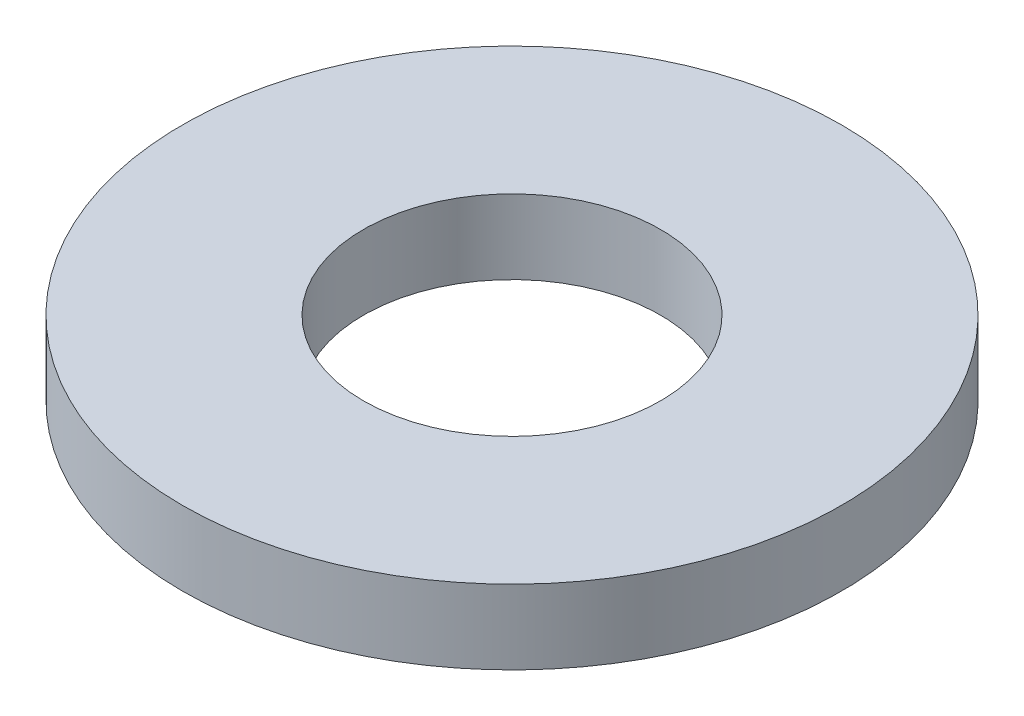
ISO-10303-21;
HEADER;
FILE_DESCRIPTION(('STEP AP214'),'2;1');
FILE_NAME('part.step','',(''),(''),'','','');
FILE_SCHEMA(('AUTOMOTIVE_DESIGN { 1 0 10303 214 1 1 1 1 }'));
ENDSEC;
DATA;
#1=APPLICATION_CONTEXT('core data for automotive mechanical design processes');
#2=APPLICATION_PROTOCOL_DEFINITION('international standard','automotive_design',2000,#1);
#3=PRODUCT_CONTEXT('',#1,'mechanical');
#4=PRODUCT('Part','Part','',(#3));
#5=PRODUCT_RELATED_PRODUCT_CATEGORY('part','',(#4));
#6=PRODUCT_DEFINITION_FORMATION('','',#4);
#7=PRODUCT_DEFINITION_CONTEXT('part definition',#1,'design');
#8=PRODUCT_DEFINITION('design','',#6,#7);
#9=PRODUCT_DEFINITION_SHAPE('','',#8);
#10=(LENGTH_UNIT() NAMED_UNIT(*) SI_UNIT(.MILLI.,.METRE.));
#11=(NAMED_UNIT(*) PLANE_ANGLE_UNIT() SI_UNIT($,.RADIAN.));
#12=(NAMED_UNIT(*) SI_UNIT($,.STERADIAN.) SOLID_ANGLE_UNIT());
#13=UNCERTAINTY_MEASURE_WITH_UNIT(LENGTH_MEASURE(1.E-05),#10,'distance_accuracy_value','');
#14=(GEOMETRIC_REPRESENTATION_CONTEXT(3) GLOBAL_UNCERTAINTY_ASSIGNED_CONTEXT((#13)) GLOBAL_UNIT_ASSIGNED_CONTEXT((#10,
#11,#12)) REPRESENTATION_CONTEXT('',''));
#15=CARTESIAN_POINT('',(0.,0.,0.));
#16=DIRECTION('',(0.,0.,1.));
#17=DIRECTION('',(1.,0.,0.));
#18=AXIS2_PLACEMENT_3D('',#15,#16,#17);
#19=CARTESIAN_POINT('',(0.,2.,0.));
#20=DIRECTION('',(0.,1.,0.));
#21=DIRECTION('',(0.,0.,1.));
#22=AXIS2_PLACEMENT_3D('',#19,#20,#21);
#23=PLANE('',#22);
#24=CARTESIAN_POINT('',(0.,2.,0.));
#25=DIRECTION('',(0.,1.,0.));
#26=DIRECTION('',(0.,0.,1.));
#27=AXIS2_PLACEMENT_3D('',#24,#25,#26);
#28=CIRCLE('',#27,8.875);
#29=CARTESIAN_POINT('',(0.,2.,8.875));
#30=VERTEX_POINT('',#29);
#31=EDGE_CURVE('E10',#30,#30,#28,.T.);
#32=ORIENTED_EDGE('',*,*,#31,.T.);
#33=EDGE_LOOP('',(#32));
#34=FACE_BOUND('',#33,.T.);
#35=CARTESIAN_POINT('',(0.,2.,0.));
#36=DIRECTION('',(0.,1.,0.));
#37=DIRECTION('',(0.,0.,1.));
#38=AXIS2_PLACEMENT_3D('',#35,#36,#37);
#39=CIRCLE('',#38,4.);
#40=CARTESIAN_POINT('',(0.,2.,4.));
#41=VERTEX_POINT('',#40);
#42=EDGE_CURVE('E50',#41,#41,#39,.T.);
#43=ORIENTED_EDGE('',*,*,#42,.F.);
#44=EDGE_LOOP('',(#43));
#45=FACE_BOUND('',#44,.T.);
#46=ADVANCED_FACE('F37',(#34,#45),#23,.T.);
#47=CARTESIAN_POINT('',(0.,0.,0.));
#48=DIRECTION('',(0.,1.,0.));
#49=DIRECTION('',(0.,0.,1.));
#50=AXIS2_PLACEMENT_3D('',#47,#48,#49);
#51=PLANE('',#50);
#52=CARTESIAN_POINT('',(0.,0.,0.));
#53=DIRECTION('',(0.,1.,0.));
#54=DIRECTION('',(0.,0.,1.));
#55=AXIS2_PLACEMENT_3D('',#52,#53,#54);
#56=CIRCLE('',#55,8.875);
#57=CARTESIAN_POINT('',(0.,0.,8.875));
#58=VERTEX_POINT('',#57);
#59=EDGE_CURVE('E41',#58,#58,#56,.T.);
#60=ORIENTED_EDGE('',*,*,#59,.F.);
#61=EDGE_LOOP('',(#60));
#62=FACE_BOUND('',#61,.T.);
#63=CARTESIAN_POINT('',(0.,0.,0.));
#64=DIRECTION('',(0.,1.,0.));
#65=DIRECTION('',(0.,0.,1.));
#66=AXIS2_PLACEMENT_3D('',#63,#64,#65);
#67=CIRCLE('',#66,4.);
#68=CARTESIAN_POINT('',(0.,0.,4.));
#69=VERTEX_POINT('',#68);
#70=EDGE_CURVE('E52',#69,#69,#67,.T.);
#71=ORIENTED_EDGE('',*,*,#70,.T.);
#72=EDGE_LOOP('',(#71));
#73=FACE_BOUND('',#72,.T.);
#74=ADVANCED_FACE('F64',(#62,#73),#51,.F.);
#75=CARTESIAN_POINT('',(0.,2.,0.));
#76=DIRECTION('',(0.,-1.,0.));
#77=DIRECTION('',(0.,0.,-1.));
#78=AXIS2_PLACEMENT_3D('',#75,#76,#77);
#79=CYLINDRICAL_SURFACE('',#78,8.875);
#80=ORIENTED_EDGE('',*,*,#31,.F.);
#81=EDGE_LOOP('',(#80));
#82=FACE_BOUND('',#81,.T.);
#83=ORIENTED_EDGE('',*,*,#59,.T.);
#84=EDGE_LOOP('',(#83));
#85=FACE_BOUND('',#84,.T.);
#86=ADVANCED_FACE('F39',(#82,#85),#79,.T.);
#87=CARTESIAN_POINT('',(0.,2.,0.));
#88=DIRECTION('',(0.,-1.,0.));
#89=DIRECTION('',(0.,0.,-1.));
#90=AXIS2_PLACEMENT_3D('',#87,#88,#89);
#91=CYLINDRICAL_SURFACE('',#90,4.);
#92=ORIENTED_EDGE('',*,*,#42,.T.);
#93=EDGE_LOOP('',(#92));
#94=FACE_BOUND('',#93,.T.);
#95=ORIENTED_EDGE('',*,*,#70,.F.);
#96=EDGE_LOOP('',(#95));
#97=FACE_BOUND('',#96,.T.);
#98=ADVANCED_FACE('F60',(#94,#97),#91,.F.);
#99=CLOSED_SHELL('',(#46,#74,#86,#98));
#100=MANIFOLD_SOLID_BREP('B2',#99);
#101=ADVANCED_BREP_SHAPE_REPRESENTATION('',(#18,#100),#14);
#102=SHAPE_DEFINITION_REPRESENTATION(#9,#101);
ENDSEC;
END-ISO-10303-21;
